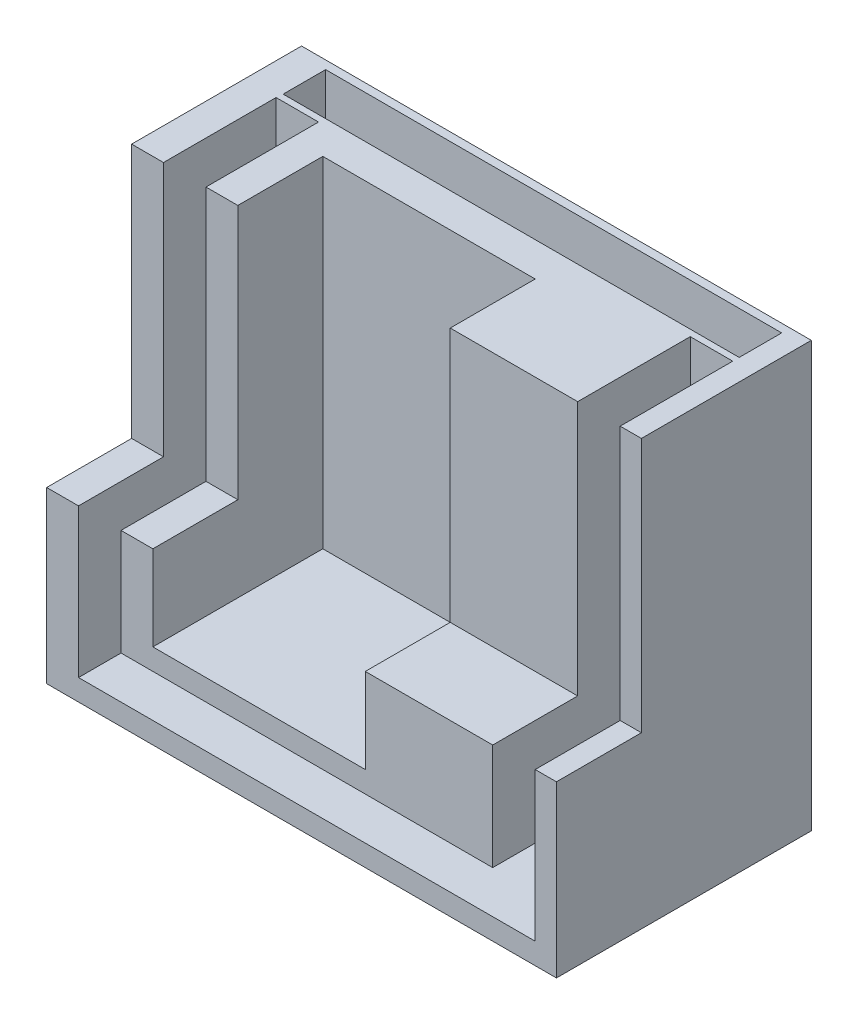
ISO-10303-21;
HEADER;
FILE_DESCRIPTION(('STEP AP214'),'2;1');
FILE_NAME('part.step','',(''),(''),'','','');
FILE_SCHEMA(('AUTOMOTIVE_DESIGN { 1 0 10303 214 1 1 1 1 }'));
ENDSEC;
DATA;
#1=APPLICATION_CONTEXT('core data for automotive mechanical design processes');
#2=APPLICATION_PROTOCOL_DEFINITION('international standard','automotive_design',2000,#1);
#3=PRODUCT_CONTEXT('',#1,'mechanical');
#4=PRODUCT('Part','Part','',(#3));
#5=PRODUCT_RELATED_PRODUCT_CATEGORY('part','',(#4));
#6=PRODUCT_DEFINITION_FORMATION('','',#4);
#7=PRODUCT_DEFINITION_CONTEXT('part definition',#1,'design');
#8=PRODUCT_DEFINITION('design','',#6,#7);
#9=PRODUCT_DEFINITION_SHAPE('','',#8);
#10=(LENGTH_UNIT() NAMED_UNIT(*) SI_UNIT(.MILLI.,.METRE.));
#11=(NAMED_UNIT(*) PLANE_ANGLE_UNIT() SI_UNIT($,.RADIAN.));
#12=(NAMED_UNIT(*) SI_UNIT($,.STERADIAN.) SOLID_ANGLE_UNIT());
#13=UNCERTAINTY_MEASURE_WITH_UNIT(LENGTH_MEASURE(1.E-05),#10,'distance_accuracy_value','');
#14=(GEOMETRIC_REPRESENTATION_CONTEXT(3) GLOBAL_UNCERTAINTY_ASSIGNED_CONTEXT((#13)) GLOBAL_UNIT_ASSIGNED_CONTEXT((#10,
#11,#12)) REPRESENTATION_CONTEXT('',''));
#15=CARTESIAN_POINT('',(0.,0.,0.));
#16=DIRECTION('',(0.,0.,1.));
#17=DIRECTION('',(1.,0.,0.));
#18=AXIS2_PLACEMENT_3D('',#15,#16,#17);
#19=CARTESIAN_POINT('',(57.5,-36.7612815177936,24.3280723329065));
#20=DIRECTION('',(1.,0.,0.));
#21=DIRECTION('',(0.,0.,-1.));
#22=AXIS2_PLACEMENT_3D('',#19,#20,#21);
#23=PLANE('',#22);
#24=DIRECTION('',(0.,0.,-1.));
#25=VECTOR('',#24,1.);
#26=CARTESIAN_POINT('',(57.5,-12.7612815177936,24.3280723329065));
#27=LINE('',#26,#25);
#28=CARTESIAN_POINT('',(57.5,-12.7612815177936,24.3280723329065));
#29=VERTEX_POINT('',#28);
#30=CARTESIAN_POINT('',(57.5,-12.7612815177936,19.3280723329065));
#31=VERTEX_POINT('',#30);
#32=EDGE_CURVE('E57',#29,#31,#27,.T.);
#33=ORIENTED_EDGE('',*,*,#32,.F.);
#34=DIRECTION('',(0.,1.,0.));
#35=VECTOR('',#34,1.);
#36=CARTESIAN_POINT('',(57.5,-36.7612815177936,24.3280723329065));
#37=LINE('',#36,#35);
#38=CARTESIAN_POINT('',(57.5,11.2387184822064,24.3280723329065));
#39=VERTEX_POINT('',#38);
#40=EDGE_CURVE('E285',#29,#39,#37,.T.);
#41=ORIENTED_EDGE('',*,*,#40,.T.);
#42=DIRECTION('',(0.,0.,-1.));
#43=VECTOR('',#42,1.);
#44=CARTESIAN_POINT('',(57.5,11.2387184822064,24.3280723329065));
#45=LINE('',#44,#43);
#46=CARTESIAN_POINT('',(57.5,11.2387184822064,19.3280723329065));
#47=VERTEX_POINT('',#46);
#48=EDGE_CURVE('E267',#39,#47,#45,.T.);
#49=ORIENTED_EDGE('',*,*,#48,.T.);
#50=DIRECTION('',(0.,1.,0.));
#51=VECTOR('',#50,1.);
#52=CARTESIAN_POINT('',(57.5,-36.7612815177936,19.3280723329065));
#53=LINE('',#52,#51);
#54=EDGE_CURVE('E257',#31,#47,#53,.T.);
#55=ORIENTED_EDGE('',*,*,#54,.F.);
#56=EDGE_LOOP('',(#33,#41,#49,#55));
#57=FACE_BOUND('',#56,.T.);
#58=ADVANCED_FACE('F41',(#57),#23,.F.);
#59=CARTESIAN_POINT('',(57.5,-36.7612815177936,24.3280723329065));
#60=DIRECTION('',(0.,0.,1.));
#61=DIRECTION('',(0.,-1.,0.));
#62=AXIS2_PLACEMENT_3D('',#59,#60,#61);
#63=PLANE('',#62);
#64=DIRECTION('',(1.,0.,0.));
#65=VECTOR('',#64,1.);
#66=CARTESIAN_POINT('',(3.82237368876439,-12.7612815177936,24.3280723329065));
#67=LINE('',#66,#65);
#68=CARTESIAN_POINT('',(3.82237368876439,-12.7612815177936,24.3280723329065));
#69=VERTEX_POINT('',#68);
#70=EDGE_CURVE('E64',#69,#29,#67,.T.);
#71=ORIENTED_EDGE('',*,*,#70,.F.);
#72=DIRECTION('',(0.,1.,0.));
#73=VECTOR('',#72,1.);
#74=CARTESIAN_POINT('',(3.82237368876439,-36.7612815177936,24.3280723329065));
#75=LINE('',#74,#73);
#76=CARTESIAN_POINT('',(3.82237368876439,11.2387184822064,24.3280723329065));
#77=VERTEX_POINT('',#76);
#78=EDGE_CURVE('E256',#69,#77,#75,.T.);
#79=ORIENTED_EDGE('',*,*,#78,.T.);
#80=DIRECTION('',(1.,0.,0.));
#81=VECTOR('',#80,1.);
#82=CARTESIAN_POINT('',(57.5,11.2387184822064,24.3280723329065));
#83=LINE('',#82,#81);
#84=EDGE_CURVE('E281',#77,#39,#83,.T.);
#85=ORIENTED_EDGE('',*,*,#84,.T.);
#86=ORIENTED_EDGE('',*,*,#40,.F.);
#87=EDGE_LOOP('',(#71,#79,#85,#86));
#88=FACE_BOUND('',#87,.T.);
#89=ADVANCED_FACE('F675',(#88),#63,.F.);
#90=CARTESIAN_POINT('',(3.82237368876439,-36.7612815177936,24.3280723329065));
#91=DIRECTION('',(-1.,0.,0.));
#92=DIRECTION('',(0.,0.,1.));
#93=AXIS2_PLACEMENT_3D('',#90,#91,#92);
#94=PLANE('',#93);
#95=DIRECTION('',(0.,0.,1.));
#96=VECTOR('',#95,1.);
#97=CARTESIAN_POINT('',(3.82237368876439,-12.7612815177936,24.3280723329065));
#98=LINE('',#97,#96);
#99=CARTESIAN_POINT('',(3.82237368876439,-12.7612815177936,19.3280723329065));
#100=VERTEX_POINT('',#99);
#101=EDGE_CURVE('E260',#100,#69,#98,.T.);
#102=ORIENTED_EDGE('',*,*,#101,.F.);
#103=DIRECTION('',(0.,1.,0.));
#104=VECTOR('',#103,1.);
#105=CARTESIAN_POINT('',(3.82237368876439,-36.7612815177936,19.3280723329065));
#106=LINE('',#105,#104);
#107=CARTESIAN_POINT('',(3.82237368876439,11.2387184822064,19.3280723329065));
#108=VERTEX_POINT('',#107);
#109=EDGE_CURVE('E245',#100,#108,#106,.T.);
#110=ORIENTED_EDGE('',*,*,#109,.T.);
#111=DIRECTION('',(0.,0.,1.));
#112=VECTOR('',#111,1.);
#113=CARTESIAN_POINT('',(3.82237368876439,11.2387184822064,24.3280723329065));
#114=LINE('',#113,#112);
#115=EDGE_CURVE('E278',#108,#77,#114,.T.);
#116=ORIENTED_EDGE('',*,*,#115,.T.);
#117=ORIENTED_EDGE('',*,*,#78,.F.);
#118=EDGE_LOOP('',(#102,#110,#116,#117));
#119=FACE_BOUND('',#118,.T.);
#120=ADVANCED_FACE('F261',(#119),#94,.F.);
#121=CARTESIAN_POINT('',(57.5,-36.7612815177936,19.3280723329065));
#122=DIRECTION('',(0.,0.,-1.));
#123=DIRECTION('',(0.,1.,0.));
#124=AXIS2_PLACEMENT_3D('',#121,#122,#123);
#125=PLANE('',#124);
#126=DIRECTION('',(-1.,0.,0.));
#127=VECTOR('',#126,1.);
#128=CARTESIAN_POINT('',(3.82237368876439,-12.7612815177936,19.3280723329065));
#129=LINE('',#128,#127);
#130=EDGE_CURVE('E249',#31,#100,#129,.T.);
#131=ORIENTED_EDGE('',*,*,#130,.F.);
#132=ORIENTED_EDGE('',*,*,#54,.T.);
#133=DIRECTION('',(-1.,0.,0.));
#134=VECTOR('',#133,1.);
#135=CARTESIAN_POINT('',(57.5,11.2387184822064,19.3280723329065));
#136=LINE('',#135,#134);
#137=EDGE_CURVE('E251',#47,#108,#136,.T.);
#138=ORIENTED_EDGE('',*,*,#137,.T.);
#139=ORIENTED_EDGE('',*,*,#109,.F.);
#140=EDGE_LOOP('',(#131,#132,#138,#139));
#141=FACE_BOUND('',#140,.T.);
#142=ADVANCED_FACE('F247',(#141),#125,.F.);
#143=CARTESIAN_POINT('',(60.,-38.7612815177936,48.3393856340684));
#144=DIRECTION('',(0.,0.,-1.));
#145=DIRECTION('',(-1.,0.,0.));
#146=AXIS2_PLACEMENT_3D('',#143,#144,#145);
#147=PLANE('',#146);
#148=DIRECTION('',(-1.,0.,0.));
#149=VECTOR('',#148,1.);
#150=CARTESIAN_POINT('',(0.,-31.2612815177936,48.3393856340684));
#151=LINE('',#150,#149);
#152=CARTESIAN_POINT('',(52.5,-31.2612815177936,48.3393856340684));
#153=VERTEX_POINT('',#152);
#154=CARTESIAN_POINT('',(8.75000000000002,-31.2612815177936,48.3393856340684));
#155=VERTEX_POINT('',#154);
#156=EDGE_CURVE('E391',#153,#155,#151,.T.);
#157=ORIENTED_EDGE('',*,*,#156,.F.);
#158=DIRECTION('',(0.,1.,0.));
#159=VECTOR('',#158,1.);
#160=CARTESIAN_POINT('',(52.5,-28.7612815177936,48.3393856340684));
#161=LINE('',#160,#159);
#162=CARTESIAN_POINT('',(52.5,-18.7612815177936,48.3393856340684));
#163=VERTEX_POINT('',#162);
#164=EDGE_CURVE('E366',#153,#163,#161,.T.);
#165=ORIENTED_EDGE('',*,*,#164,.T.);
#166=DIRECTION('',(-1.,0.,0.));
#167=VECTOR('',#166,1.);
#168=CARTESIAN_POINT('',(60.,-18.7612815177936,48.3393856340684));
#169=LINE('',#168,#167);
#170=CARTESIAN_POINT('',(37.5,-18.7612815177936,48.3393856340684));
#171=VERTEX_POINT('',#170);
#172=EDGE_CURVE('E546',#163,#171,#169,.T.);
#173=ORIENTED_EDGE('',*,*,#172,.T.);
#174=DIRECTION('',(0.,-1.,0.));
#175=VECTOR('',#174,1.);
#176=CARTESIAN_POINT('',(37.5,0.,48.3393856340684));
#177=LINE('',#176,#175);
#178=CARTESIAN_POINT('',(37.5,-28.7612815177936,48.3393856340684));
#179=VERTEX_POINT('',#178);
#180=EDGE_CURVE('E438',#171,#179,#177,.T.);
#181=ORIENTED_EDGE('',*,*,#180,.T.);
#182=DIRECTION('',(1.,0.,0.));
#183=VECTOR('',#182,1.);
#184=CARTESIAN_POINT('',(0.,-28.7612815177936,48.3393856340684));
#185=LINE('',#184,#183);
#186=CARTESIAN_POINT('',(12.5,-28.7612815177936,48.3393856340684));
#187=VERTEX_POINT('',#186);
#188=EDGE_CURVE('E388',#187,#179,#185,.T.);
#189=ORIENTED_EDGE('',*,*,#188,.F.);
#190=DIRECTION('',(0.,-1.,0.));
#191=VECTOR('',#190,1.);
#192=CARTESIAN_POINT('',(12.5,0.,48.3393856340684));
#193=LINE('',#192,#191);
#194=CARTESIAN_POINT('',(12.5,-18.7612815177936,48.3393856340684));
#195=VERTEX_POINT('',#194);
#196=EDGE_CURVE('E459',#195,#187,#193,.T.);
#197=ORIENTED_EDGE('',*,*,#196,.F.);
#198=CARTESIAN_POINT('',(8.75000000000001,-18.7612815177936,48.3393856340684));
#199=VERTEX_POINT('',#198);
#200=EDGE_CURVE('E627',#195,#199,#169,.T.);
#201=ORIENTED_EDGE('',*,*,#200,.T.);
#202=DIRECTION('',(0.,-1.,0.));
#203=VECTOR('',#202,1.);
#204=CARTESIAN_POINT('',(8.75000000000001,0.,48.3393856340684));
#205=LINE('',#204,#203);
#206=EDGE_CURVE('E439',#199,#155,#205,.T.);
#207=ORIENTED_EDGE('',*,*,#206,.T.);
#208=EDGE_LOOP('',(#157,#165,#173,#181,#189,#197,#201,#207));
#209=FACE_BOUND('',#208,.T.);
#210=ADVANCED_FACE('F624',(#209),#147,.F.);
#211=CARTESIAN_POINT('',(60.,-18.7612815177936,38.3393856340684));
#212=DIRECTION('',(0.,0.,-1.));
#213=DIRECTION('',(-1.,0.,0.));
#214=AXIS2_PLACEMENT_3D('',#211,#212,#213);
#215=PLANE('',#214);
#216=DIRECTION('',(-1.,0.,0.));
#217=VECTOR('',#216,1.);
#218=CARTESIAN_POINT('',(60.,11.2387184822064,38.3393856340684));
#219=LINE('',#218,#217);
#220=CARTESIAN_POINT('',(60.,11.2387184822064,38.3393856340684));
#221=VERTEX_POINT('',#220);
#222=CARTESIAN_POINT('',(57.5,11.2387184822064,38.3393856340684));
#223=VERTEX_POINT('',#222);
#224=EDGE_CURVE('E535',#221,#223,#219,.T.);
#225=ORIENTED_EDGE('',*,*,#224,.T.);
#226=DIRECTION('',(0.,-1.,0.));
#227=VECTOR('',#226,1.);
#228=CARTESIAN_POINT('',(57.5,-18.7612815177936,38.3393856340684));
#229=LINE('',#228,#227);
#230=CARTESIAN_POINT('',(57.5,-18.7612815177936,38.3393856340684));
#231=VERTEX_POINT('',#230);
#232=EDGE_CURVE('E384',#223,#231,#229,.T.);
#233=ORIENTED_EDGE('',*,*,#232,.T.);
#234=DIRECTION('',(-1.,0.,0.));
#235=VECTOR('',#234,1.);
#236=CARTESIAN_POINT('',(60.,-18.7612815177936,38.3393856340684));
#237=LINE('',#236,#235);
#238=CARTESIAN_POINT('',(60.,-18.7612815177936,38.3393856340684));
#239=VERTEX_POINT('',#238);
#240=EDGE_CURVE('E547',#239,#231,#237,.T.);
#241=ORIENTED_EDGE('',*,*,#240,.F.);
#242=DIRECTION('',(0.,-1.,0.));
#243=VECTOR('',#242,1.);
#244=CARTESIAN_POINT('',(60.,-18.7612815177936,38.3393856340684));
#245=LINE('',#244,#243);
#246=EDGE_CURVE('E507',#221,#239,#245,.T.);
#247=ORIENTED_EDGE('',*,*,#246,.F.);
#248=EDGE_LOOP('',(#225,#233,#241,#247));
#249=FACE_BOUND('',#248,.T.);
#250=ADVANCED_FACE('F795',(#249),#215,.F.);
#251=CARTESIAN_POINT('',(60.,-18.7612815177936,48.3393856340684));
#252=DIRECTION('',(0.,-1.,0.));
#253=DIRECTION('',(0.,0.,-1.));
#254=AXIS2_PLACEMENT_3D('',#251,#252,#253);
#255=PLANE('',#254);
#256=ORIENTED_EDGE('',*,*,#240,.T.);
#257=DIRECTION('',(0.,0.,1.));
#258=VECTOR('',#257,1.);
#259=CARTESIAN_POINT('',(57.5,-18.7612815177936,48.3393856340684));
#260=LINE('',#259,#258);
#261=CARTESIAN_POINT('',(57.5,-18.7612815177936,48.3393856340684));
#262=VERTEX_POINT('',#261);
#263=EDGE_CURVE('E380',#231,#262,#260,.T.);
#264=ORIENTED_EDGE('',*,*,#263,.T.);
#265=CARTESIAN_POINT('',(60.,-18.7612815177936,48.3393856340684));
#266=VERTEX_POINT('',#265);
#267=EDGE_CURVE('E541',#266,#262,#169,.T.);
#268=ORIENTED_EDGE('',*,*,#267,.F.);
#269=DIRECTION('',(0.,0.,1.));
#270=VECTOR('',#269,1.);
#271=CARTESIAN_POINT('',(60.,-18.7612815177936,48.3393856340684));
#272=LINE('',#271,#270);
#273=EDGE_CURVE('E511',#239,#266,#272,.T.);
#274=ORIENTED_EDGE('',*,*,#273,.F.);
#275=EDGE_LOOP('',(#256,#264,#268,#274));
#276=FACE_BOUND('',#275,.T.);
#277=ADVANCED_FACE('F808',(#276),#255,.F.);
#278=CARTESIAN_POINT('',(3.75,0.,28.3393856340684));
#279=DIRECTION('',(-1.,0.,0.));
#280=DIRECTION('',(0.,-1.,0.));
#281=AXIS2_PLACEMENT_3D('',#278,#279,#280);
#282=PLANE('',#281);
#283=DIRECTION('',(0.,-1.,0.));
#284=VECTOR('',#283,1.);
#285=CARTESIAN_POINT('',(3.75,0.,48.3393856340684));
#286=LINE('',#285,#284);
#287=CARTESIAN_POINT('',(3.75000000000001,-18.7612815177936,48.3393856340684));
#288=VERTEX_POINT('',#287);
#289=CARTESIAN_POINT('',(3.75000000000001,-36.2612815177936,48.3393856340684));
#290=VERTEX_POINT('',#289);
#291=EDGE_CURVE('E442',#288,#290,#286,.T.);
#292=ORIENTED_EDGE('',*,*,#291,.T.);
#293=DIRECTION('',(0.,0.,1.));
#294=VECTOR('',#293,1.);
#295=CARTESIAN_POINT('',(3.75000000000001,-36.2612815177936,28.3393856340684));
#296=LINE('',#295,#294);
#297=CARTESIAN_POINT('',(3.75,-36.2612815177936,25.0893856340684));
#298=VERTEX_POINT('',#297);
#299=EDGE_CURVE('E427',#298,#290,#296,.T.);
#300=ORIENTED_EDGE('',*,*,#299,.F.);
#301=DIRECTION('',(0.,1.,0.));
#302=VECTOR('',#301,1.);
#303=CARTESIAN_POINT('',(3.75,-38.7612815177936,25.0893856340684));
#304=LINE('',#303,#302);
#305=CARTESIAN_POINT('',(3.75,11.2387184822064,25.0893856340684));
#306=VERTEX_POINT('',#305);
#307=EDGE_CURVE('E320',#298,#306,#304,.T.);
#308=ORIENTED_EDGE('',*,*,#307,.T.);
#309=DIRECTION('',(0.,0.,1.));
#310=VECTOR('',#309,1.);
#311=CARTESIAN_POINT('',(3.75,11.2387184822064,28.3393856340684));
#312=LINE('',#311,#310);
#313=CARTESIAN_POINT('',(3.75,11.2387184822064,38.3393856340684));
#314=VERTEX_POINT('',#313);
#315=EDGE_CURVE('E447',#306,#314,#312,.T.);
#316=ORIENTED_EDGE('',*,*,#315,.T.);
#317=DIRECTION('',(0.,1.,0.));
#318=VECTOR('',#317,1.);
#319=CARTESIAN_POINT('',(3.75000000000001,-18.7612815177936,38.3393856340684));
#320=LINE('',#319,#318);
#321=CARTESIAN_POINT('',(3.75000000000001,-18.7612815177936,38.3393856340684));
#322=VERTEX_POINT('',#321);
#323=EDGE_CURVE('E496',#322,#314,#320,.T.);
#324=ORIENTED_EDGE('',*,*,#323,.F.);
#325=DIRECTION('',(0.,0.,-1.));
#326=VECTOR('',#325,1.);
#327=CARTESIAN_POINT('',(3.75000000000001,-18.7612815177936,48.3393856340684));
#328=LINE('',#327,#326);
#329=EDGE_CURVE('E492',#288,#322,#328,.T.);
#330=ORIENTED_EDGE('',*,*,#329,.F.);
#331=EDGE_LOOP('',(#292,#300,#308,#316,#324,#330));
#332=FACE_BOUND('',#331,.T.);
#333=ADVANCED_FACE('F638',(#332),#282,.F.);
#334=CARTESIAN_POINT('',(8.75000000000001,0.,28.3393856340684));
#335=DIRECTION('',(-1.,0.,0.));
#336=DIRECTION('',(0.,-1.,0.));
#337=AXIS2_PLACEMENT_3D('',#334,#335,#336);
#338=PLANE('',#337);
#339=DIRECTION('',(0.,-1.,0.));
#340=VECTOR('',#339,1.);
#341=CARTESIAN_POINT('',(8.75000000000001,0.,25.3393856340684));
#342=LINE('',#341,#340);
#343=CARTESIAN_POINT('',(8.75000000000001,-31.2612815177936,25.3393856340684));
#344=VERTEX_POINT('',#343);
#345=CARTESIAN_POINT('',(8.75000000000001,-36.2612815177936,25.3393856340684));
#346=VERTEX_POINT('',#345);
#347=EDGE_CURVE('E314',#344,#346,#342,.T.);
#348=ORIENTED_EDGE('',*,*,#347,.F.);
#349=DIRECTION('',(0.,0.,1.));
#350=VECTOR('',#349,1.);
#351=CARTESIAN_POINT('',(8.75000000000002,-31.2612815177936,20.8393856340684));
#352=LINE('',#351,#350);
#353=EDGE_CURVE('E353',#344,#155,#352,.T.);
#354=ORIENTED_EDGE('',*,*,#353,.T.);
#355=ORIENTED_EDGE('',*,*,#206,.F.);
#356=DIRECTION('',(0.,0.,-1.));
#357=VECTOR('',#356,1.);
#358=CARTESIAN_POINT('',(8.75000000000001,-18.7612815177936,48.3393856340684));
#359=LINE('',#358,#357);
#360=CARTESIAN_POINT('',(8.75000000000001,-18.7612815177936,38.3393856340684));
#361=VERTEX_POINT('',#360);
#362=EDGE_CURVE('E500',#199,#361,#359,.T.);
#363=ORIENTED_EDGE('',*,*,#362,.T.);
#364=DIRECTION('',(0.,1.,0.));
#365=VECTOR('',#364,1.);
#366=CARTESIAN_POINT('',(8.75000000000001,-18.7612815177936,38.3393856340684));
#367=LINE('',#366,#365);
#368=CARTESIAN_POINT('',(8.75000000000001,11.2387184822064,38.3393856340684));
#369=VERTEX_POINT('',#368);
#370=EDGE_CURVE('E503',#361,#369,#367,.T.);
#371=ORIENTED_EDGE('',*,*,#370,.T.);
#372=DIRECTION('',(0.,0.,1.));
#373=VECTOR('',#372,1.);
#374=CARTESIAN_POINT('',(8.75000000000001,11.2387184822064,28.3393856340684));
#375=LINE('',#374,#373);
#376=CARTESIAN_POINT('',(8.75000000000001,11.2387184822064,25.0893856340684));
#377=VERTEX_POINT('',#376);
#378=EDGE_CURVE('E446',#377,#369,#375,.T.);
#379=ORIENTED_EDGE('',*,*,#378,.F.);
#380=DIRECTION('',(0.,1.,0.));
#381=VECTOR('',#380,1.);
#382=CARTESIAN_POINT('',(8.75000000000001,-38.7612815177936,25.0893856340684));
#383=LINE('',#382,#381);
#384=CARTESIAN_POINT('',(8.75000000000001,-36.2612815177936,25.0893856340684));
#385=VERTEX_POINT('',#384);
#386=EDGE_CURVE('E328',#385,#377,#383,.T.);
#387=ORIENTED_EDGE('',*,*,#386,.F.);
#388=DIRECTION('',(0.,0.,-1.));
#389=VECTOR('',#388,1.);
#390=CARTESIAN_POINT('',(8.75000000000001,-36.2612815177936,20.8393856340684));
#391=LINE('',#390,#389);
#392=EDGE_CURVE('E50',#346,#385,#391,.T.);
#393=ORIENTED_EDGE('',*,*,#392,.F.);
#394=EDGE_LOOP('',(#348,#354,#355,#363,#371,#379,#387,#393));
#395=FACE_BOUND('',#394,.T.);
#396=ADVANCED_FACE('F565',(#395),#338,.T.);
#397=CARTESIAN_POINT('',(0.,0.,28.3393856340684));
#398=DIRECTION('',(0.,0.,1.));
#399=DIRECTION('',(1.,0.,0.));
#400=AXIS2_PLACEMENT_3D('',#397,#398,#399);
#401=PLANE('',#400);
#402=DIRECTION('',(0.,-1.,0.));
#403=VECTOR('',#402,1.);
#404=CARTESIAN_POINT('',(12.5,0.,28.3393856340684));
#405=LINE('',#404,#403);
#406=CARTESIAN_POINT('',(12.5,11.2387184822064,28.3393856340684));
#407=VERTEX_POINT('',#406);
#408=CARTESIAN_POINT('',(12.5,-28.7612815177936,28.3393856340684));
#409=VERTEX_POINT('',#408);
#410=EDGE_CURVE('E463',#407,#409,#405,.T.);
#411=ORIENTED_EDGE('',*,*,#410,.T.);
#412=DIRECTION('',(1.,0.,0.));
#413=VECTOR('',#412,1.);
#414=CARTESIAN_POINT('',(0.,-28.7612815177936,28.3393856340684));
#415=LINE('',#414,#413);
#416=CARTESIAN_POINT('',(37.5,-28.7612815177936,28.3393856340684));
#417=VERTEX_POINT('',#416);
#418=EDGE_CURVE('E399',#409,#417,#415,.T.);
#419=ORIENTED_EDGE('',*,*,#418,.T.);
#420=DIRECTION('',(0.,-1.,0.));
#421=VECTOR('',#420,1.);
#422=CARTESIAN_POINT('',(37.5,0.,28.3393856340684));
#423=LINE('',#422,#421);
#424=CARTESIAN_POINT('',(37.5,11.2387184822064,28.3393856340684));
#425=VERTEX_POINT('',#424);
#426=EDGE_CURVE('E454',#425,#417,#423,.T.);
#427=ORIENTED_EDGE('',*,*,#426,.F.);
#428=DIRECTION('',(1.,0.,0.));
#429=VECTOR('',#428,1.);
#430=CARTESIAN_POINT('',(0.,11.2387184822064,28.3393856340684));
#431=LINE('',#430,#429);
#432=EDGE_CURVE('E458',#407,#425,#431,.T.);
#433=ORIENTED_EDGE('',*,*,#432,.F.);
#434=EDGE_LOOP('',(#411,#419,#427,#433));
#435=FACE_BOUND('',#434,.T.);
#436=ADVANCED_FACE('F660',(#435),#401,.T.);
#437=CARTESIAN_POINT('',(12.5,0.,28.3393856340684));
#438=DIRECTION('',(-1.,0.,0.));
#439=DIRECTION('',(0.,-1.,0.));
#440=AXIS2_PLACEMENT_3D('',#437,#438,#439);
#441=PLANE('',#440);
#442=DIRECTION('',(0.,0.,1.));
#443=VECTOR('',#442,1.);
#444=CARTESIAN_POINT('',(12.5,-28.7612815177936,28.3393856340684));
#445=LINE('',#444,#443);
#446=EDGE_CURVE('E403',#409,#187,#445,.T.);
#447=ORIENTED_EDGE('',*,*,#446,.F.);
#448=ORIENTED_EDGE('',*,*,#410,.F.);
#449=DIRECTION('',(0.,0.,1.));
#450=VECTOR('',#449,1.);
#451=CARTESIAN_POINT('',(12.5,11.2387184822064,28.3393856340684));
#452=LINE('',#451,#450);
#453=CARTESIAN_POINT('',(12.5,11.2387184822064,38.3393856340684));
#454=VERTEX_POINT('',#453);
#455=EDGE_CURVE('E443',#407,#454,#452,.T.);
#456=ORIENTED_EDGE('',*,*,#455,.T.);
#457=DIRECTION('',(0.,1.,0.));
#458=VECTOR('',#457,1.);
#459=CARTESIAN_POINT('',(12.5,-18.7612815177936,38.3393856340684));
#460=LINE('',#459,#458);
#461=CARTESIAN_POINT('',(12.5,-18.7612815177936,38.3393856340684));
#462=VERTEX_POINT('',#461);
#463=EDGE_CURVE('E482',#462,#454,#460,.T.);
#464=ORIENTED_EDGE('',*,*,#463,.F.);
#465=DIRECTION('',(0.,0.,-1.));
#466=VECTOR('',#465,1.);
#467=CARTESIAN_POINT('',(12.5,-18.7612815177936,48.3393856340684));
#468=LINE('',#467,#466);
#469=EDGE_CURVE('E450',#195,#462,#468,.T.);
#470=ORIENTED_EDGE('',*,*,#469,.F.);
#471=ORIENTED_EDGE('',*,*,#196,.T.);
#472=EDGE_LOOP('',(#447,#448,#456,#464,#470,#471));
#473=FACE_BOUND('',#472,.T.);
#474=ADVANCED_FACE('F657',(#473),#441,.F.);
#475=CARTESIAN_POINT('',(37.5,0.,28.3393856340684));
#476=DIRECTION('',(-1.,0.,0.));
#477=DIRECTION('',(0.,-1.,0.));
#478=AXIS2_PLACEMENT_3D('',#475,#476,#477);
#479=PLANE('',#478);
#480=ORIENTED_EDGE('',*,*,#426,.T.);
#481=DIRECTION('',(0.,0.,1.));
#482=VECTOR('',#481,1.);
#483=CARTESIAN_POINT('',(37.5,-28.7612815177936,28.3393856340684));
#484=LINE('',#483,#482);
#485=EDGE_CURVE('E395',#417,#179,#484,.T.);
#486=ORIENTED_EDGE('',*,*,#485,.T.);
#487=ORIENTED_EDGE('',*,*,#180,.F.);
#488=DIRECTION('',(0.,0.,-1.));
#489=VECTOR('',#488,1.);
#490=CARTESIAN_POINT('',(37.5,-18.7612815177936,48.3393856340684));
#491=LINE('',#490,#489);
#492=CARTESIAN_POINT('',(37.5,-18.7612815177936,38.3393856340684));
#493=VERTEX_POINT('',#492);
#494=EDGE_CURVE('E486',#171,#493,#491,.T.);
#495=ORIENTED_EDGE('',*,*,#494,.T.);
#496=DIRECTION('',(0.,1.,0.));
#497=VECTOR('',#496,1.);
#498=CARTESIAN_POINT('',(37.5,-18.7612815177936,38.3393856340684));
#499=LINE('',#498,#497);
#500=CARTESIAN_POINT('',(37.5,11.2387184822064,38.3393856340684));
#501=VERTEX_POINT('',#500);
#502=EDGE_CURVE('E489',#493,#501,#499,.T.);
#503=ORIENTED_EDGE('',*,*,#502,.T.);
#504=DIRECTION('',(0.,0.,1.));
#505=VECTOR('',#504,1.);
#506=CARTESIAN_POINT('',(37.5,11.2387184822064,28.3393856340684));
#507=LINE('',#506,#505);
#508=EDGE_CURVE('E467',#425,#501,#507,.T.);
#509=ORIENTED_EDGE('',*,*,#508,.F.);
#510=EDGE_LOOP('',(#480,#486,#487,#495,#503,#509));
#511=FACE_BOUND('',#510,.T.);
#512=ADVANCED_FACE('F621',(#511),#479,.T.);
#513=CARTESIAN_POINT('',(52.5,-18.7612815177936,38.3393856340684));
#514=VERTEX_POINT('',#513);
#515=EDGE_CURVE('E550',#514,#493,#237,.T.);
#516=ORIENTED_EDGE('',*,*,#515,.F.);
#517=DIRECTION('',(0.,1.,0.));
#518=VECTOR('',#517,1.);
#519=CARTESIAN_POINT('',(52.5,-18.7612815177936,38.3393856340684));
#520=LINE('',#519,#518);
#521=CARTESIAN_POINT('',(52.5,11.2387184822064,38.3393856340684));
#522=VERTEX_POINT('',#521);
#523=EDGE_CURVE('E376',#514,#522,#520,.T.);
#524=ORIENTED_EDGE('',*,*,#523,.T.);
#525=EDGE_CURVE('E540',#522,#501,#219,.T.);
#526=ORIENTED_EDGE('',*,*,#525,.T.);
#527=ORIENTED_EDGE('',*,*,#502,.F.);
#528=EDGE_LOOP('',(#516,#524,#526,#527));
#529=FACE_BOUND('',#528,.T.);
#530=ADVANCED_FACE('F612',(#529),#215,.F.);
#531=ORIENTED_EDGE('',*,*,#172,.F.);
#532=DIRECTION('',(0.,0.,-1.));
#533=VECTOR('',#532,1.);
#534=CARTESIAN_POINT('',(52.5,-18.7612815177936,48.3393856340684));
#535=LINE('',#534,#533);
#536=EDGE_CURVE('E370',#163,#514,#535,.T.);
#537=ORIENTED_EDGE('',*,*,#536,.T.);
#538=ORIENTED_EDGE('',*,*,#515,.T.);
#539=ORIENTED_EDGE('',*,*,#494,.F.);
#540=EDGE_LOOP('',(#531,#537,#538,#539));
#541=FACE_BOUND('',#540,.T.);
#542=ADVANCED_FACE('F606',(#541),#255,.F.);
#543=ORIENTED_EDGE('',*,*,#370,.F.);
#544=EDGE_CURVE('E597',#462,#361,#237,.T.);
#545=ORIENTED_EDGE('',*,*,#544,.F.);
#546=ORIENTED_EDGE('',*,*,#463,.T.);
#547=EDGE_CURVE('E572',#454,#369,#219,.T.);
#548=ORIENTED_EDGE('',*,*,#547,.T.);
#549=EDGE_LOOP('',(#543,#545,#546,#548));
#550=FACE_BOUND('',#549,.T.);
#551=ADVANCED_FACE('F575',(#550),#215,.F.);
#552=ORIENTED_EDGE('',*,*,#362,.F.);
#553=ORIENTED_EDGE('',*,*,#200,.F.);
#554=ORIENTED_EDGE('',*,*,#469,.T.);
#555=ORIENTED_EDGE('',*,*,#544,.T.);
#556=EDGE_LOOP('',(#552,#553,#554,#555));
#557=FACE_BOUND('',#556,.T.);
#558=ADVANCED_FACE('F654',(#557),#255,.F.);
#559=CARTESIAN_POINT('',(0.,-18.7612815177936,48.3393856340684));
#560=VERTEX_POINT('',#559);
#561=EDGE_CURVE('E539',#288,#560,#169,.T.);
#562=ORIENTED_EDGE('',*,*,#561,.F.);
#563=ORIENTED_EDGE('',*,*,#329,.T.);
#564=CARTESIAN_POINT('',(0.,-18.7612815177936,38.3393856340684));
#565=VERTEX_POINT('',#564);
#566=EDGE_CURVE('E545',#322,#565,#237,.T.);
#567=ORIENTED_EDGE('',*,*,#566,.T.);
#568=DIRECTION('',(0.,0.,1.));
#569=VECTOR('',#568,1.);
#570=CARTESIAN_POINT('',(0.,-18.7612815177936,48.3393856340684));
#571=LINE('',#570,#569);
#572=EDGE_CURVE('E526',#565,#560,#571,.T.);
#573=ORIENTED_EDGE('',*,*,#572,.T.);
#574=EDGE_LOOP('',(#562,#563,#567,#573));
#575=FACE_BOUND('',#574,.T.);
#576=ADVANCED_FACE('F595',(#575),#255,.F.);
#577=ORIENTED_EDGE('',*,*,#566,.F.);
#578=ORIENTED_EDGE('',*,*,#323,.T.);
#579=CARTESIAN_POINT('',(0.,11.2387184822064,38.3393856340684));
#580=VERTEX_POINT('',#579);
#581=EDGE_CURVE('E522',#314,#580,#219,.T.);
#582=ORIENTED_EDGE('',*,*,#581,.T.);
#583=DIRECTION('',(0.,-1.,0.));
#584=VECTOR('',#583,1.);
#585=CARTESIAN_POINT('',(0.,-18.7612815177936,38.3393856340684));
#586=LINE('',#585,#584);
#587=EDGE_CURVE('E506',#580,#565,#586,.T.);
#588=ORIENTED_EDGE('',*,*,#587,.T.);
#589=EDGE_LOOP('',(#577,#578,#582,#588));
#590=FACE_BOUND('',#589,.T.);
#591=ADVANCED_FACE('F43',(#590),#215,.F.);
#592=CARTESIAN_POINT('',(60.,11.2387184822064,38.3393856340684));
#593=DIRECTION('',(0.,-1.,0.));
#594=DIRECTION('',(0.,0.,-1.));
#595=AXIS2_PLACEMENT_3D('',#592,#593,#594);
#596=PLANE('',#595);
#597=ORIENTED_EDGE('',*,*,#137,.F.);
#598=ORIENTED_EDGE('',*,*,#48,.F.);
#599=ORIENTED_EDGE('',*,*,#84,.F.);
#600=ORIENTED_EDGE('',*,*,#115,.F.);
#601=EDGE_LOOP('',(#597,#598,#599,#600));
#602=FACE_BOUND('',#601,.T.);
#603=DIRECTION('',(0.,0.,1.));
#604=VECTOR('',#603,1.);
#605=CARTESIAN_POINT('',(52.5,11.2387184822064,0.));
#606=LINE('',#605,#604);
#607=CARTESIAN_POINT('',(52.5,11.2387184822064,25.0893856340684));
#608=VERTEX_POINT('',#607);
#609=EDGE_CURVE('E360',#608,#522,#606,.T.);
#610=ORIENTED_EDGE('',*,*,#609,.F.);
#611=DIRECTION('',(-1.,0.,0.));
#612=VECTOR('',#611,1.);
#613=CARTESIAN_POINT('',(52.5,11.2387184822064,25.0893856340684));
#614=LINE('',#613,#612);
#615=CARTESIAN_POINT('',(57.5,11.2387184822064,25.0893856340684));
#616=VERTEX_POINT('',#615);
#617=EDGE_CURVE('E344',#616,#608,#614,.T.);
#618=ORIENTED_EDGE('',*,*,#617,.F.);
#619=DIRECTION('',(0.,0.,-1.));
#620=VECTOR('',#619,1.);
#621=CARTESIAN_POINT('',(57.5,11.2387184822064,0.));
#622=LINE('',#621,#620);
#623=EDGE_CURVE('E363',#223,#616,#622,.T.);
#624=ORIENTED_EDGE('',*,*,#623,.F.);
#625=ORIENTED_EDGE('',*,*,#224,.F.);
#626=DIRECTION('',(0.,0.,1.));
#627=VECTOR('',#626,1.);
#628=CARTESIAN_POINT('',(60.,11.2387184822064,38.3393856340684));
#629=LINE('',#628,#627);
#630=CARTESIAN_POINT('',(60.,11.2387184822064,18.3393856340684));
#631=VERTEX_POINT('',#630);
#632=EDGE_CURVE('E519',#631,#221,#629,.T.);
#633=ORIENTED_EDGE('',*,*,#632,.F.);
#634=DIRECTION('',(-1.,0.,0.));
#635=VECTOR('',#634,1.);
#636=CARTESIAN_POINT('',(60.,11.2387184822064,18.3393856340684));
#637=LINE('',#636,#635);
#638=CARTESIAN_POINT('',(0.,11.2387184822064,18.3393856340684));
#639=VERTEX_POINT('',#638);
#640=EDGE_CURVE('E406',#631,#639,#637,.T.);
#641=ORIENTED_EDGE('',*,*,#640,.T.);
#642=DIRECTION('',(0.,0.,1.));
#643=VECTOR('',#642,1.);
#644=CARTESIAN_POINT('',(0.,11.2387184822064,38.3393856340684));
#645=LINE('',#644,#643);
#646=EDGE_CURVE('E512',#639,#580,#645,.T.);
#647=ORIENTED_EDGE('',*,*,#646,.T.);
#648=ORIENTED_EDGE('',*,*,#581,.F.);
#649=ORIENTED_EDGE('',*,*,#315,.F.);
#650=DIRECTION('',(1.,0.,0.));
#651=VECTOR('',#650,1.);
#652=CARTESIAN_POINT('',(52.5,11.2387184822064,25.0893856340684));
#653=LINE('',#652,#651);
#654=EDGE_CURVE('E317',#306,#377,#653,.T.);
#655=ORIENTED_EDGE('',*,*,#654,.T.);
#656=ORIENTED_EDGE('',*,*,#378,.T.);
#657=ORIENTED_EDGE('',*,*,#547,.F.);
#658=ORIENTED_EDGE('',*,*,#455,.F.);
#659=ORIENTED_EDGE('',*,*,#432,.T.);
#660=ORIENTED_EDGE('',*,*,#508,.T.);
#661=ORIENTED_EDGE('',*,*,#525,.F.);
#662=EDGE_LOOP('',(#610,#618,#624,#625,#633,#641,#647,#648,#649,#655,#656,#657,#658,#659,#660,#661));
#663=FACE_BOUND('',#662,.T.);
#664=ADVANCED_FACE('F570',(#602,#663),#596,.F.);
#665=DIRECTION('',(0.,1.,0.));
#666=VECTOR('',#665,1.);
#667=CARTESIAN_POINT('',(57.5,-28.7612815177936,48.3393856340684));
#668=LINE('',#667,#666);
#669=CARTESIAN_POINT('',(57.5,-36.2612815177936,48.3393856340684));
#670=VERTEX_POINT('',#669);
#671=EDGE_CURVE('E367',#670,#262,#668,.T.);
#672=ORIENTED_EDGE('',*,*,#671,.F.);
#673=DIRECTION('',(1.,0.,0.));
#674=VECTOR('',#673,1.);
#675=CARTESIAN_POINT('',(0.,-36.2612815177936,48.3393856340684));
#676=LINE('',#675,#674);
#677=EDGE_CURVE('E411',#290,#670,#676,.T.);
#678=ORIENTED_EDGE('',*,*,#677,.F.);
#679=ORIENTED_EDGE('',*,*,#291,.F.);
#680=ORIENTED_EDGE('',*,*,#561,.T.);
#681=DIRECTION('',(0.,-1.,0.));
#682=VECTOR('',#681,1.);
#683=CARTESIAN_POINT('',(0.,-38.7612815177936,48.3393856340684));
#684=LINE('',#683,#682);
#685=CARTESIAN_POINT('',(0.,-38.7612815177936,48.3393856340684));
#686=VERTEX_POINT('',#685);
#687=EDGE_CURVE('E530',#560,#686,#684,.T.);
#688=ORIENTED_EDGE('',*,*,#687,.T.);
#689=DIRECTION('',(1.,0.,0.));
#690=VECTOR('',#689,1.);
#691=CARTESIAN_POINT('',(3.75000000000001,-38.7612815177936,48.3393856340684));
#692=LINE('',#691,#690);
#693=CARTESIAN_POINT('',(60.,-38.7612815177936,48.3393856340684));
#694=VERTEX_POINT('',#693);
#695=EDGE_CURVE('E431',#686,#694,#692,.T.);
#696=ORIENTED_EDGE('',*,*,#695,.T.);
#697=DIRECTION('',(0.,-1.,0.));
#698=VECTOR('',#697,1.);
#699=CARTESIAN_POINT('',(60.,-38.7612815177936,48.3393856340684));
#700=LINE('',#699,#698);
#701=EDGE_CURVE('E515',#266,#694,#700,.T.);
#702=ORIENTED_EDGE('',*,*,#701,.F.);
#703=ORIENTED_EDGE('',*,*,#267,.T.);
#704=EDGE_LOOP('',(#672,#678,#679,#680,#688,#696,#702,#703));
#705=FACE_BOUND('',#704,.T.);
#706=ADVANCED_FACE('F635',(#705),#147,.F.);
#707=CARTESIAN_POINT('',(0.,0.,0.));
#708=DIRECTION('',(-1.,0.,0.));
#709=DIRECTION('',(0.,0.,1.));
#710=AXIS2_PLACEMENT_3D('',#707,#708,#709);
#711=PLANE('',#710);
#712=ORIENTED_EDGE('',*,*,#646,.F.);
#713=DIRECTION('',(0.,1.,0.));
#714=VECTOR('',#713,1.);
#715=CARTESIAN_POINT('',(0.,11.2387184822064,18.3393856340684));
#716=LINE('',#715,#714);
#717=CARTESIAN_POINT('',(0.,-38.7612815177936,18.3393856340684));
#718=VERTEX_POINT('',#717);
#719=EDGE_CURVE('E412',#718,#639,#716,.T.);
#720=ORIENTED_EDGE('',*,*,#719,.F.);
#721=DIRECTION('',(0.,0.,1.));
#722=VECTOR('',#721,1.);
#723=CARTESIAN_POINT('',(0.,-38.7612815177936,20.8393856340684));
#724=LINE('',#723,#722);
#725=EDGE_CURVE('E434',#718,#686,#724,.T.);
#726=ORIENTED_EDGE('',*,*,#725,.T.);
#727=ORIENTED_EDGE('',*,*,#687,.F.);
#728=ORIENTED_EDGE('',*,*,#572,.F.);
#729=ORIENTED_EDGE('',*,*,#587,.F.);
#730=EDGE_LOOP('',(#712,#720,#726,#727,#728,#729));
#731=FACE_BOUND('',#730,.T.);
#732=ADVANCED_FACE('F590',(#731),#711,.T.);
#733=CARTESIAN_POINT('',(60.,0.,0.));
#734=DIRECTION('',(-1.,0.,0.));
#735=DIRECTION('',(0.,0.,1.));
#736=AXIS2_PLACEMENT_3D('',#733,#734,#735);
#737=PLANE('',#736);
#738=DIRECTION('',(0.,1.,0.));
#739=VECTOR('',#738,1.);
#740=CARTESIAN_POINT('',(60.,11.2387184822064,18.3393856340684));
#741=LINE('',#740,#739);
#742=CARTESIAN_POINT('',(60.,-38.7612815177936,18.3393856340684));
#743=VERTEX_POINT('',#742);
#744=EDGE_CURVE('E419',#743,#631,#741,.T.);
#745=ORIENTED_EDGE('',*,*,#744,.T.);
#746=ORIENTED_EDGE('',*,*,#632,.T.);
#747=ORIENTED_EDGE('',*,*,#246,.T.);
#748=ORIENTED_EDGE('',*,*,#273,.T.);
#749=ORIENTED_EDGE('',*,*,#701,.T.);
#750=DIRECTION('',(0.,0.,-1.));
#751=VECTOR('',#750,1.);
#752=CARTESIAN_POINT('',(60.,-38.7612815177936,18.3393856340684));
#753=LINE('',#752,#751);
#754=EDGE_CURVE('E415',#694,#743,#753,.T.);
#755=ORIENTED_EDGE('',*,*,#754,.T.);
#756=EDGE_LOOP('',(#745,#746,#747,#748,#749,#755));
#757=FACE_BOUND('',#756,.T.);
#758=ADVANCED_FACE('F783',(#757),#737,.F.);
#759=CARTESIAN_POINT('',(0.,-31.2612815177936,20.8393856340684));
#760=DIRECTION('',(0.,-1.,0.));
#761=DIRECTION('',(0.,0.,-1.));
#762=AXIS2_PLACEMENT_3D('',#759,#760,#761);
#763=PLANE('',#762);
#764=ORIENTED_EDGE('',*,*,#353,.F.);
#765=DIRECTION('',(-1.,0.,0.));
#766=VECTOR('',#765,1.);
#767=CARTESIAN_POINT('',(3.75000000000001,-31.2612815177936,25.3393856340684));
#768=LINE('',#767,#766);
#769=CARTESIAN_POINT('',(52.5,-31.2612815177936,25.3393856340684));
#770=VERTEX_POINT('',#769);
#771=EDGE_CURVE('E298',#770,#344,#768,.T.);
#772=ORIENTED_EDGE('',*,*,#771,.F.);
#773=DIRECTION('',(0.,0.,-1.));
#774=VECTOR('',#773,1.);
#775=CARTESIAN_POINT('',(52.5,-31.2612815177936,0.));
#776=LINE('',#775,#774);
#777=EDGE_CURVE('E306',#153,#770,#776,.T.);
#778=ORIENTED_EDGE('',*,*,#777,.F.);
#779=ORIENTED_EDGE('',*,*,#156,.T.);
#780=EDGE_LOOP('',(#764,#772,#778,#779));
#781=FACE_BOUND('',#780,.T.);
#782=ADVANCED_FACE('F653',(#781),#763,.T.);
#783=CARTESIAN_POINT('',(3.75000000000001,-38.7612815177936,20.8393856340684));
#784=DIRECTION('',(0.,-1.,0.));
#785=DIRECTION('',(0.,0.,-1.));
#786=AXIS2_PLACEMENT_3D('',#783,#784,#785);
#787=PLANE('',#786);
#788=ORIENTED_EDGE('',*,*,#754,.F.);
#789=ORIENTED_EDGE('',*,*,#695,.F.);
#790=ORIENTED_EDGE('',*,*,#725,.F.);
#791=DIRECTION('',(-1.,0.,0.));
#792=VECTOR('',#791,1.);
#793=CARTESIAN_POINT('',(60.,-38.7612815177936,18.3393856340684));
#794=LINE('',#793,#792);
#795=EDGE_CURVE('E407',#743,#718,#794,.T.);
#796=ORIENTED_EDGE('',*,*,#795,.F.);
#797=EDGE_LOOP('',(#788,#789,#790,#796));
#798=FACE_BOUND('',#797,.T.);
#799=ADVANCED_FACE('F770',(#798),#787,.T.);
#800=CARTESIAN_POINT('',(0.,-36.2612815177936,20.8393856340684));
#801=DIRECTION('',(0.,-1.,0.));
#802=DIRECTION('',(0.,0.,-1.));
#803=AXIS2_PLACEMENT_3D('',#800,#801,#802);
#804=PLANE('',#803);
#805=DIRECTION('',(1.,0.,0.));
#806=VECTOR('',#805,1.);
#807=CARTESIAN_POINT('',(3.75000000000001,-36.2612815177936,25.3393856340684));
#808=LINE('',#807,#806);
#809=CARTESIAN_POINT('',(57.5,-36.2612815177936,25.3393856340684));
#810=VERTEX_POINT('',#809);
#811=EDGE_CURVE('E288',#346,#810,#808,.T.);
#812=ORIENTED_EDGE('',*,*,#811,.F.);
#813=ORIENTED_EDGE('',*,*,#392,.T.);
#814=DIRECTION('',(-1.,0.,0.));
#815=VECTOR('',#814,1.);
#816=CARTESIAN_POINT('',(0.,-36.2612815177936,25.0893856340684));
#817=LINE('',#816,#815);
#818=EDGE_CURVE('E324',#385,#298,#817,.T.);
#819=ORIENTED_EDGE('',*,*,#818,.T.);
#820=ORIENTED_EDGE('',*,*,#299,.T.);
#821=ORIENTED_EDGE('',*,*,#677,.T.);
#822=DIRECTION('',(0.,0.,1.));
#823=VECTOR('',#822,1.);
#824=CARTESIAN_POINT('',(57.5,-36.2612815177936,25.3393856340684));
#825=LINE('',#824,#823);
#826=EDGE_CURVE('E302',#810,#670,#825,.T.);
#827=ORIENTED_EDGE('',*,*,#826,.F.);
#828=EDGE_LOOP('',(#812,#813,#819,#820,#821,#827));
#829=FACE_BOUND('',#828,.T.);
#830=ADVANCED_FACE('F556',(#829),#804,.F.);
#831=CARTESIAN_POINT('',(60.,11.2387184822064,18.3393856340684));
#832=DIRECTION('',(0.,0.,1.));
#833=DIRECTION('',(0.,-1.,0.));
#834=AXIS2_PLACEMENT_3D('',#831,#832,#833);
#835=PLANE('',#834);
#836=ORIENTED_EDGE('',*,*,#719,.T.);
#837=ORIENTED_EDGE('',*,*,#640,.F.);
#838=ORIENTED_EDGE('',*,*,#744,.F.);
#839=ORIENTED_EDGE('',*,*,#795,.T.);
#840=EDGE_LOOP('',(#836,#837,#838,#839));
#841=FACE_BOUND('',#840,.T.);
#842=ADVANCED_FACE('F664',(#841),#835,.F.);
#843=CARTESIAN_POINT('',(0.,-28.7612815177936,27.8393856340684));
#844=DIRECTION('',(0.,-1.,0.));
#845=DIRECTION('',(0.,0.,-1.));
#846=AXIS2_PLACEMENT_3D('',#843,#844,#845);
#847=PLANE('',#846);
#848=ORIENTED_EDGE('',*,*,#418,.F.);
#849=ORIENTED_EDGE('',*,*,#446,.T.);
#850=ORIENTED_EDGE('',*,*,#188,.T.);
#851=ORIENTED_EDGE('',*,*,#485,.F.);
#852=EDGE_LOOP('',(#848,#849,#850,#851));
#853=FACE_BOUND('',#852,.T.);
#854=ADVANCED_FACE('F662',(#853),#847,.F.);
#855=CARTESIAN_POINT('',(57.5,-28.7612815177936,0.));
#856=DIRECTION('',(1.,0.,0.));
#857=DIRECTION('',(0.,0.,-1.));
#858=AXIS2_PLACEMENT_3D('',#855,#856,#857);
#859=PLANE('',#858);
#860=ORIENTED_EDGE('',*,*,#671,.T.);
#861=ORIENTED_EDGE('',*,*,#263,.F.);
#862=ORIENTED_EDGE('',*,*,#232,.F.);
#863=ORIENTED_EDGE('',*,*,#623,.T.);
#864=DIRECTION('',(0.,1.,0.));
#865=VECTOR('',#864,1.);
#866=CARTESIAN_POINT('',(57.5,11.2387184822064,25.0893856340684));
#867=LINE('',#866,#865);
#868=CARTESIAN_POINT('',(57.5,-32.0112815177936,25.0893856340684));
#869=VERTEX_POINT('',#868);
#870=EDGE_CURVE('E340',#869,#616,#867,.T.);
#871=ORIENTED_EDGE('',*,*,#870,.F.);
#872=DIRECTION('',(0.,0.,1.));
#873=VECTOR('',#872,1.);
#874=CARTESIAN_POINT('',(57.5,-32.0112815177936,25.0893856340684));
#875=LINE('',#874,#873);
#876=CARTESIAN_POINT('',(57.5,-32.0112815177936,25.3393856340684));
#877=VERTEX_POINT('',#876);
#878=EDGE_CURVE('E349',#869,#877,#875,.T.);
#879=ORIENTED_EDGE('',*,*,#878,.T.);
#880=DIRECTION('',(0.,1.,0.));
#881=VECTOR('',#880,1.);
#882=CARTESIAN_POINT('',(57.5,-36.2612815177936,25.3393856340684));
#883=LINE('',#882,#881);
#884=EDGE_CURVE('E295',#810,#877,#883,.T.);
#885=ORIENTED_EDGE('',*,*,#884,.F.);
#886=ORIENTED_EDGE('',*,*,#826,.T.);
#887=EDGE_LOOP('',(#860,#861,#862,#863,#871,#879,#885,#886));
#888=FACE_BOUND('',#887,.T.);
#889=ADVANCED_FACE('F643',(#888),#859,.F.);
#890=CARTESIAN_POINT('',(52.5,-28.7612815177936,0.));
#891=DIRECTION('',(-1.,0.,0.));
#892=DIRECTION('',(0.,0.,1.));
#893=AXIS2_PLACEMENT_3D('',#890,#891,#892);
#894=PLANE('',#893);
#895=ORIENTED_EDGE('',*,*,#164,.F.);
#896=ORIENTED_EDGE('',*,*,#777,.T.);
#897=DIRECTION('',(0.,-1.,0.));
#898=VECTOR('',#897,1.);
#899=CARTESIAN_POINT('',(52.5,-28.7612815177936,25.3393856340684));
#900=LINE('',#899,#898);
#901=CARTESIAN_POINT('',(52.5,-32.0112815177936,25.3393856340684));
#902=VERTEX_POINT('',#901);
#903=EDGE_CURVE('E310',#770,#902,#900,.T.);
#904=ORIENTED_EDGE('',*,*,#903,.T.);
#905=DIRECTION('',(0.,0.,1.));
#906=VECTOR('',#905,1.);
#907=CARTESIAN_POINT('',(52.5,-32.0112815177936,25.0893856340684));
#908=LINE('',#907,#906);
#909=CARTESIAN_POINT('',(52.5,-32.0112815177936,25.0893856340684));
#910=VERTEX_POINT('',#909);
#911=EDGE_CURVE('E348',#910,#902,#908,.T.);
#912=ORIENTED_EDGE('',*,*,#911,.F.);
#913=DIRECTION('',(0.,-1.,0.));
#914=VECTOR('',#913,1.);
#915=CARTESIAN_POINT('',(52.5,11.2387184822064,25.0893856340684));
#916=LINE('',#915,#914);
#917=EDGE_CURVE('E332',#608,#910,#916,.T.);
#918=ORIENTED_EDGE('',*,*,#917,.F.);
#919=ORIENTED_EDGE('',*,*,#609,.T.);
#920=ORIENTED_EDGE('',*,*,#523,.F.);
#921=ORIENTED_EDGE('',*,*,#536,.F.);
#922=EDGE_LOOP('',(#895,#896,#904,#912,#918,#919,#920,#921));
#923=FACE_BOUND('',#922,.T.);
#924=ADVANCED_FACE('F615',(#923),#894,.F.);
#925=CARTESIAN_POINT('',(52.5,-32.0112815177936,25.0893856340684));
#926=DIRECTION('',(0.,-1.,0.));
#927=DIRECTION('',(0.,0.,-1.));
#928=AXIS2_PLACEMENT_3D('',#925,#926,#927);
#929=PLANE('',#928);
#930=ORIENTED_EDGE('',*,*,#911,.T.);
#931=DIRECTION('',(1.,0.,0.));
#932=VECTOR('',#931,1.);
#933=CARTESIAN_POINT('',(52.5,-32.0112815177936,25.3393856340684));
#934=LINE('',#933,#932);
#935=EDGE_CURVE('E11',#902,#877,#934,.T.);
#936=ORIENTED_EDGE('',*,*,#935,.T.);
#937=ORIENTED_EDGE('',*,*,#878,.F.);
#938=DIRECTION('',(1.,0.,0.));
#939=VECTOR('',#938,1.);
#940=CARTESIAN_POINT('',(52.5,-32.0112815177936,25.0893856340684));
#941=LINE('',#940,#939);
#942=EDGE_CURVE('E336',#910,#869,#941,.T.);
#943=ORIENTED_EDGE('',*,*,#942,.F.);
#944=EDGE_LOOP('',(#930,#936,#937,#943));
#945=FACE_BOUND('',#944,.T.);
#946=ADVANCED_FACE('F648',(#945),#929,.F.);
#947=CARTESIAN_POINT('',(0.,0.,25.0893856340684));
#948=DIRECTION('',(0.,0.,1.));
#949=DIRECTION('',(1.,0.,0.));
#950=AXIS2_PLACEMENT_3D('',#947,#948,#949);
#951=PLANE('',#950);
#952=ORIENTED_EDGE('',*,*,#917,.T.);
#953=ORIENTED_EDGE('',*,*,#942,.T.);
#954=ORIENTED_EDGE('',*,*,#870,.T.);
#955=ORIENTED_EDGE('',*,*,#617,.T.);
#956=EDGE_LOOP('',(#952,#953,#954,#955));
#957=FACE_BOUND('',#956,.T.);
#958=ADVANCED_FACE('F689',(#957),#951,.T.);
#959=CARTESIAN_POINT('',(52.5,-38.7612815177936,25.0893856340684));
#960=DIRECTION('',(0.,0.,1.));
#961=DIRECTION('',(0.,-1.,0.));
#962=AXIS2_PLACEMENT_3D('',#959,#960,#961);
#963=PLANE('',#962);
#964=ORIENTED_EDGE('',*,*,#818,.F.);
#965=ORIENTED_EDGE('',*,*,#386,.T.);
#966=ORIENTED_EDGE('',*,*,#654,.F.);
#967=ORIENTED_EDGE('',*,*,#307,.F.);
#968=EDGE_LOOP('',(#964,#965,#966,#967));
#969=FACE_BOUND('',#968,.T.);
#970=ADVANCED_FACE('F563',(#969),#963,.T.);
#971=CARTESIAN_POINT('',(0.,0.,25.3393856340684));
#972=DIRECTION('',(0.,0.,-1.));
#973=DIRECTION('',(-1.,0.,0.));
#974=AXIS2_PLACEMENT_3D('',#971,#972,#973);
#975=PLANE('',#974);
#976=ORIENTED_EDGE('',*,*,#347,.T.);
#977=ORIENTED_EDGE('',*,*,#811,.T.);
#978=ORIENTED_EDGE('',*,*,#884,.T.);
#979=ORIENTED_EDGE('',*,*,#935,.F.);
#980=ORIENTED_EDGE('',*,*,#903,.F.);
#981=ORIENTED_EDGE('',*,*,#771,.T.);
#982=EDGE_LOOP('',(#976,#977,#978,#979,#980,#981));
#983=FACE_BOUND('',#982,.T.);
#984=ADVANCED_FACE('F646',(#983),#975,.F.);
#985=CARTESIAN_POINT('',(0.,-12.7612815177936,0.));
#986=DIRECTION('',(0.,-1.,0.));
#987=DIRECTION('',(0.,0.,-1.));
#988=AXIS2_PLACEMENT_3D('',#985,#986,#987);
#989=PLANE('',#988);
#990=ORIENTED_EDGE('',*,*,#101,.T.);
#991=ORIENTED_EDGE('',*,*,#70,.T.);
#992=ORIENTED_EDGE('',*,*,#32,.T.);
#993=ORIENTED_EDGE('',*,*,#130,.T.);
#994=EDGE_LOOP('',(#990,#991,#992,#993));
#995=FACE_BOUND('',#994,.T.);
#996=ADVANCED_FACE('F265',(#995),#989,.F.);
#997=CLOSED_SHELL('',(#58,#89,#120,#142,#210,#250,#277,#333,#396,#436,#474,#512,#530,#542,#551,
#558,#576,#591,#664,#706,#732,#758,#782,#799,#830,#842,#854,#889,#924,#946,#958,#970,#984,#996));
#998=MANIFOLD_SOLID_BREP('B2',#997);
#999=ADVANCED_BREP_SHAPE_REPRESENTATION('',(#18,#998),#14);
#1000=SHAPE_DEFINITION_REPRESENTATION(#9,#999);
ENDSEC;
END-ISO-10303-21;
